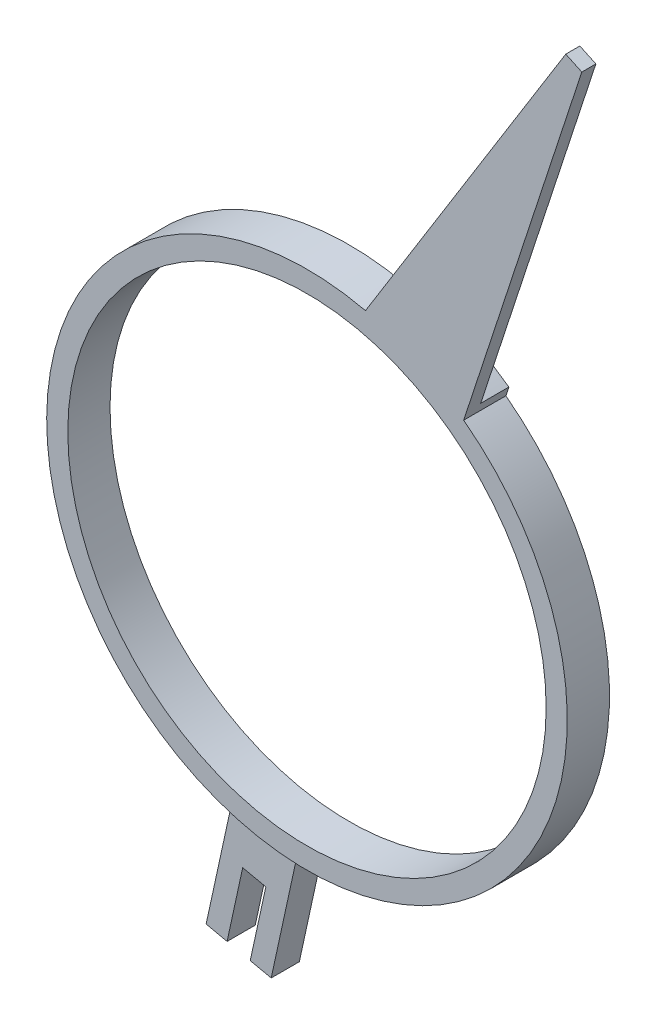
ISO-10303-21;
HEADER;
FILE_DESCRIPTION(('STEP AP214'),'2;1');
FILE_NAME('part.step','',(''),(''),'','','');
FILE_SCHEMA(('AUTOMOTIVE_DESIGN { 1 0 10303 214 1 1 1 1 }'));
ENDSEC;
DATA;
#1=APPLICATION_CONTEXT('core data for automotive mechanical design processes');
#2=APPLICATION_PROTOCOL_DEFINITION('international standard','automotive_design',2000,#1);
#3=PRODUCT_CONTEXT('',#1,'mechanical');
#4=PRODUCT('Part','Part','',(#3));
#5=PRODUCT_RELATED_PRODUCT_CATEGORY('part','',(#4));
#6=PRODUCT_DEFINITION_FORMATION('','',#4);
#7=PRODUCT_DEFINITION_CONTEXT('part definition',#1,'design');
#8=PRODUCT_DEFINITION('design','',#6,#7);
#9=PRODUCT_DEFINITION_SHAPE('','',#8);
#10=(LENGTH_UNIT() NAMED_UNIT(*) SI_UNIT(.MILLI.,.METRE.));
#11=(NAMED_UNIT(*) PLANE_ANGLE_UNIT() SI_UNIT($,.RADIAN.));
#12=(NAMED_UNIT(*) SI_UNIT($,.STERADIAN.) SOLID_ANGLE_UNIT());
#13=UNCERTAINTY_MEASURE_WITH_UNIT(LENGTH_MEASURE(1.E-05),#10,'distance_accuracy_value','');
#14=(GEOMETRIC_REPRESENTATION_CONTEXT(3) GLOBAL_UNCERTAINTY_ASSIGNED_CONTEXT((#13)) GLOBAL_UNIT_ASSIGNED_CONTEXT((#10,
#11,#12)) REPRESENTATION_CONTEXT('',''));
#15=CARTESIAN_POINT('',(0.,0.,0.));
#16=DIRECTION('',(0.,0.,1.));
#17=DIRECTION('',(1.,0.,0.));
#18=AXIS2_PLACEMENT_3D('',#15,#16,#17);
#19=CARTESIAN_POINT('',(43.5290437530011,-12.4127182523964,15.853626427053));
#20=DIRECTION('',(0.,0.,-1.));
#21=DIRECTION('',(-1.,0.,0.));
#22=AXIS2_PLACEMENT_3D('',#19,#20,#21);
#23=PLANE('',#22);
#24=CARTESIAN_POINT('',(41.7501136263386,-16.1950909558502,15.853626427053));
#25=DIRECTION('',(0.,0.,1.));
#26=DIRECTION('',(1.,0.,0.));
#27=AXIS2_PLACEMENT_3D('',#24,#25,#26);
#28=CIRCLE('',#27,2.33562450801026);
#29=CARTESIAN_POINT('',(42.3011564932952,-13.9254007564629,15.853626427053));
#30=VERTEX_POINT('',#29);
#31=CARTESIAN_POINT('',(43.1345936638932,-14.3140388917033,15.853626427053));
#32=VERTEX_POINT('',#31);
#33=EDGE_CURVE('E39',#30,#32,#28,.F.);
#34=ORIENTED_EDGE('',*,*,#33,.F.);
#35=DIRECTION('',(-0.527834877618406,-0.849347009160309,0.));
#36=VECTOR('',#35,1.);
#37=CARTESIAN_POINT('',(43.1256855131825,-12.5986387581521,15.853626427053));
#38=LINE('',#37,#36);
#39=CARTESIAN_POINT('',(43.9939867514361,-11.2014422275097,15.853626427053));
#40=VERTEX_POINT('',#39);
#41=EDGE_CURVE('E120',#40,#30,#38,.T.);
#42=ORIENTED_EDGE('',*,*,#41,.F.);
#43=DIRECTION('',(-0.906307787036659,0.422618261740681,0.));
#44=VECTOR('',#43,1.);
#45=CARTESIAN_POINT('',(44.0635616972437,-11.2338855575556,15.853626427053));
#46=LINE('',#45,#44);
#47=CARTESIAN_POINT('',(44.1331366430485,-11.2663288876003,15.853626427053));
#48=VERTEX_POINT('',#47);
#49=EDGE_CURVE('E101',#48,#40,#46,.T.);
#50=ORIENTED_EDGE('',*,*,#49,.F.);
#51=DIRECTION('',(0.311351837353415,0.950294708696546,0.));
#52=VECTOR('',#51,1.);
#53=CARTESIAN_POINT('',(43.6209552822299,-12.8295868443111,15.853626427053));
#54=LINE('',#53,#52);
#55=EDGE_CURVE('E110',#32,#48,#54,.T.);
#56=ORIENTED_EDGE('',*,*,#55,.F.);
#57=EDGE_LOOP('',(#34,#42,#50,#56));
#58=FACE_BOUND('',#57,.T.);
#59=ADVANCED_FACE('F36',(#58),#23,.T.);
#60=CARTESIAN_POINT('',(43.6209552822299,-12.8295868443111,15.609626427053));
#61=DIRECTION('',(0.950294708696546,-0.311351837353415,0.));
#62=DIRECTION('',(0.311351837353415,0.950294708696546,0.));
#63=AXIS2_PLACEMENT_3D('',#60,#61,#62);
#64=PLANE('',#63);
#65=DIRECTION('',(0.,0.,1.));
#66=VECTOR('',#65,1.);
#67=CARTESIAN_POINT('',(43.1345936638933,-14.3140388917034,15.609626427053));
#68=LINE('',#67,#66);
#69=CARTESIAN_POINT('',(43.1345936638932,-14.3140388917033,15.609626427053));
#70=VERTEX_POINT('',#69);
#71=EDGE_CURVE('E117',#32,#70,#68,.F.);
#72=ORIENTED_EDGE('',*,*,#71,.F.);
#73=ORIENTED_EDGE('',*,*,#55,.T.);
#74=DIRECTION('',(0.,0.,1.));
#75=VECTOR('',#74,1.);
#76=CARTESIAN_POINT('',(44.1331366430485,-11.2663288876,15.609626427053));
#77=LINE('',#76,#75);
#78=CARTESIAN_POINT('',(44.1331366430483,-11.2663288876005,15.975626427053));
#79=VERTEX_POINT('',#78);
#80=EDGE_CURVE('E113',#79,#48,#77,.F.);
#81=ORIENTED_EDGE('',*,*,#80,.F.);
#82=DIRECTION('',(0.311351837353128,0.950294708696639,0.));
#83=VECTOR('',#82,1.);
#84=CARTESIAN_POINT('',(43.1087739214115,-14.3928448010216,15.975626427053));
#85=LINE('',#84,#83);
#86=CARTESIAN_POINT('',(43.1087739214112,-14.3928448010217,15.975626427053));
#87=VERTEX_POINT('',#86);
#88=EDGE_CURVE('E185',#87,#79,#85,.T.);
#89=ORIENTED_EDGE('',*,*,#88,.F.);
#90=DIRECTION('',(0.,0.,1.));
#91=VECTOR('',#90,1.);
#92=CARTESIAN_POINT('',(43.1087739214111,-14.3928448010214,15.609626427053));
#93=LINE('',#92,#91);
#94=CARTESIAN_POINT('',(43.108773921411,-14.3928448010216,15.609626427053));
#95=VERTEX_POINT('',#94);
#96=EDGE_CURVE('E135',#87,#95,#93,.F.);
#97=ORIENTED_EDGE('',*,*,#96,.T.);
#98=DIRECTION('',(0.311351837353415,0.950294708696546,0.));
#99=VECTOR('',#98,1.);
#100=CARTESIAN_POINT('',(43.6209552822299,-12.8295868443111,15.609626427053));
#101=LINE('',#100,#99);
#102=EDGE_CURVE('E118',#95,#70,#101,.T.);
#103=ORIENTED_EDGE('',*,*,#102,.T.);
#104=EDGE_LOOP('',(#72,#73,#81,#89,#97,#103));
#105=FACE_BOUND('',#104,.T.);
#106=ADVANCED_FACE('F111',(#105),#64,.T.);
#107=CARTESIAN_POINT('',(44.0635616972437,-11.2338855575556,15.609626427053));
#108=DIRECTION('',(0.422618261740681,0.906307787036659,0.));
#109=DIRECTION('',(-0.906307787036659,0.422618261740681,0.));
#110=AXIS2_PLACEMENT_3D('',#107,#108,#109);
#111=PLANE('',#110);
#112=ORIENTED_EDGE('',*,*,#80,.T.);
#113=ORIENTED_EDGE('',*,*,#49,.T.);
#114=DIRECTION('',(0.,0.,1.));
#115=VECTOR('',#114,1.);
#116=CARTESIAN_POINT('',(43.9939867514357,-11.2014422275095,15.609626427053));
#117=LINE('',#116,#115);
#118=CARTESIAN_POINT('',(43.9939867514365,-11.20144222751,15.975626427053));
#119=VERTEX_POINT('',#118);
#120=EDGE_CURVE('E149',#119,#40,#117,.F.);
#121=ORIENTED_EDGE('',*,*,#120,.F.);
#122=DIRECTION('',(-0.906307787034976,0.42261826174429,0.));
#123=VECTOR('',#122,1.);
#124=CARTESIAN_POINT('',(44.1331366430482,-11.2663288876007,15.975626427053));
#125=LINE('',#124,#123);
#126=EDGE_CURVE('E126',#79,#119,#125,.T.);
#127=ORIENTED_EDGE('',*,*,#126,.F.);
#128=EDGE_LOOP('',(#112,#113,#121,#127));
#129=FACE_BOUND('',#128,.T.);
#130=ADVANCED_FACE('F124',(#129),#111,.T.);
#131=CARTESIAN_POINT('',(43.1256855131825,-12.5986387581521,15.609626427053));
#132=DIRECTION('',(-0.849347009160309,0.527834877618406,0.));
#133=DIRECTION('',(-0.527834877618406,-0.849347009160309,0.));
#134=AXIS2_PLACEMENT_3D('',#131,#132,#133);
#135=PLANE('',#134);
#136=ORIENTED_EDGE('',*,*,#120,.T.);
#137=ORIENTED_EDGE('',*,*,#41,.T.);
#138=DIRECTION('',(0.,0.,1.));
#139=VECTOR('',#138,1.);
#140=CARTESIAN_POINT('',(42.3011564932952,-13.9254007564629,15.609626427053));
#141=LINE('',#140,#139);
#142=CARTESIAN_POINT('',(42.3011564932952,-13.9254007564629,15.609626427053));
#143=VERTEX_POINT('',#142);
#144=EDGE_CURVE('E225',#143,#30,#141,.T.);
#145=ORIENTED_EDGE('',*,*,#144,.F.);
#146=DIRECTION('',(-0.527834877618406,-0.849347009160309,0.));
#147=VECTOR('',#146,1.);
#148=CARTESIAN_POINT('',(43.1256855131825,-12.5986387581521,15.609626427053));
#149=LINE('',#148,#147);
#150=CARTESIAN_POINT('',(42.2573842749298,-13.9958352887938,15.609626427053));
#151=VERTEX_POINT('',#150);
#152=EDGE_CURVE('E122',#143,#151,#149,.T.);
#153=ORIENTED_EDGE('',*,*,#152,.T.);
#154=DIRECTION('',(0.,0.,1.));
#155=VECTOR('',#154,1.);
#156=CARTESIAN_POINT('',(42.25738427493,-13.9958352887934,15.609626427053));
#157=LINE('',#156,#155);
#158=CARTESIAN_POINT('',(42.2573842749302,-13.9958352887939,15.975626427053));
#159=VERTEX_POINT('',#158);
#160=EDGE_CURVE('E147',#151,#159,#157,.T.);
#161=ORIENTED_EDGE('',*,*,#160,.T.);
#162=DIRECTION('',(-0.527834877618577,-0.849347009160203,0.));
#163=VECTOR('',#162,1.);
#164=CARTESIAN_POINT('',(43.9939867514369,-11.2014422275102,15.975626427053));
#165=LINE('',#164,#163);
#166=EDGE_CURVE('E174',#119,#159,#165,.T.);
#167=ORIENTED_EDGE('',*,*,#166,.F.);
#168=EDGE_LOOP('',(#136,#137,#145,#153,#161,#167));
#169=FACE_BOUND('',#168,.T.);
#170=ADVANCED_FACE('F277',(#169),#135,.T.);
#171=CARTESIAN_POINT('',(41.7501136263386,-16.1950909558502,15.609626427053));
#172=DIRECTION('',(0.,0.,1.));
#173=DIRECTION('',(1.,0.,0.));
#174=AXIS2_PLACEMENT_3D('',#171,#172,#173);
#175=CYLINDRICAL_SURFACE('',#174,2.33562450801026);
#176=CARTESIAN_POINT('',(41.7501136263386,-16.1950909558502,15.609626427053));
#177=DIRECTION('',(0.,0.,1.));
#178=DIRECTION('',(1.,0.,0.));
#179=AXIS2_PLACEMENT_3D('',#176,#177,#178);
#180=CIRCLE('',#179,2.33562450801026);
#181=EDGE_CURVE('E167',#70,#143,#180,.T.);
#182=ORIENTED_EDGE('',*,*,#181,.T.);
#183=ORIENTED_EDGE('',*,*,#144,.T.);
#184=ORIENTED_EDGE('',*,*,#33,.T.);
#185=ORIENTED_EDGE('',*,*,#71,.T.);
#186=EDGE_LOOP('',(#182,#183,#184,#185));
#187=FACE_BOUND('',#186,.T.);
#188=ADVANCED_FACE('F438',(#187),#175,.T.);
#189=CARTESIAN_POINT('',(41.7501136263386,-16.1950909558502,15.609626427053));
#190=DIRECTION('',(0.,0.,1.));
#191=DIRECTION('',(1.,0.,0.));
#192=AXIS2_PLACEMENT_3D('',#189,#190,#191);
#193=CYLINDRICAL_SURFACE('',#192,2.074);
#194=CARTESIAN_POINT('',(41.7501136263386,-16.1950909558502,15.609626427053));
#195=DIRECTION('',(0.,0.,1.));
#196=DIRECTION('',(1.,0.,0.));
#197=AXIS2_PLACEMENT_3D('',#194,#195,#196);
#198=CIRCLE('',#197,2.074);
#199=CARTESIAN_POINT('',(43.8241136263386,-16.1950909558502,15.609626427053));
#200=VERTEX_POINT('',#199);
#201=EDGE_CURVE('E162',#200,#200,#198,.F.);
#202=ORIENTED_EDGE('',*,*,#201,.T.);
#203=EDGE_LOOP('',(#202));
#204=FACE_BOUND('',#203,.T.);
#205=CARTESIAN_POINT('',(41.7501136263386,-16.1950909558502,15.975626427053));
#206=DIRECTION('',(0.,0.,1.));
#207=DIRECTION('',(1.,0.,0.));
#208=AXIS2_PLACEMENT_3D('',#205,#206,#207);
#209=CIRCLE('',#208,2.074);
#210=CARTESIAN_POINT('',(43.8241136263386,-16.1950909558502,15.975626427053));
#211=VERTEX_POINT('',#210);
#212=EDGE_CURVE('E171',#211,#211,#209,.F.);
#213=ORIENTED_EDGE('',*,*,#212,.F.);
#214=EDGE_LOOP('',(#213));
#215=FACE_BOUND('',#214,.T.);
#216=ADVANCED_FACE('F429',(#204,#215),#193,.F.);
#217=CARTESIAN_POINT('',(40.9921043530501,-19.1941461657869,15.853626427053));
#218=DIRECTION('',(-0.977112472939913,0.212723330232603,0.));
#219=DIRECTION('',(-0.212723330232603,-0.977112472939913,0.));
#220=AXIS2_PLACEMENT_3D('',#217,#218,#219);
#221=PLANE('',#220);
#222=DIRECTION('',(-0.212723330231915,-0.977112472940062,0.));
#223=VECTOR('',#222,1.);
#224=CARTESIAN_POINT('',(41.0706923021899,-18.8331642967806,15.853626427053));
#225=LINE('',#224,#223);
#226=CARTESIAN_POINT('',(41.0706923021899,-18.8331642967806,15.853626427053));
#227=VERTEX_POINT('',#226);
#228=CARTESIAN_POINT('',(40.9353760737111,-19.4547189447533,15.853626427053));
#229=VERTEX_POINT('',#228);
#230=EDGE_CURVE('E165',#227,#229,#225,.T.);
#231=ORIENTED_EDGE('',*,*,#230,.T.);
#232=DIRECTION('',(0.,0.,1.));
#233=VECTOR('',#232,1.);
#234=CARTESIAN_POINT('',(40.9353760737109,-19.4547189447544,15.609626427053));
#235=LINE('',#234,#233);
#236=CARTESIAN_POINT('',(40.935376073711,-19.4547189447536,15.609626427053));
#237=VERTEX_POINT('',#236);
#238=EDGE_CURVE('E212',#237,#229,#235,.T.);
#239=ORIENTED_EDGE('',*,*,#238,.F.);
#240=DIRECTION('',(0.212723330231915,0.977112472940062,0.));
#241=VECTOR('',#240,1.);
#242=CARTESIAN_POINT('',(40.9353760737112,-19.4547189447528,15.609626427053));
#243=LINE('',#242,#241);
#244=CARTESIAN_POINT('',(41.0706923021899,-18.8331642967806,15.609626427053));
#245=VERTEX_POINT('',#244);
#246=EDGE_CURVE('E173',#237,#245,#243,.T.);
#247=ORIENTED_EDGE('',*,*,#246,.T.);
#248=DIRECTION('',(0.,0.,1.));
#249=VECTOR('',#248,1.);
#250=CARTESIAN_POINT('',(41.07069230219,-18.8331642967805,15.853626427053));
#251=LINE('',#250,#249);
#252=EDGE_CURVE('E236',#245,#227,#251,.T.);
#253=ORIENTED_EDGE('',*,*,#252,.T.);
#254=EDGE_LOOP('',(#231,#239,#247,#253));
#255=FACE_BOUND('',#254,.T.);
#256=ADVANCED_FACE('F329',(#255),#221,.F.);
#257=CARTESIAN_POINT('',(41.0357170274446,-19.4765637808691,15.609626427053));
#258=DIRECTION('',(-0.212723330232603,-0.977112472939913,0.));
#259=DIRECTION('',(0.977112472939913,-0.212723330232603,0.));
#260=AXIS2_PLACEMENT_3D('',#257,#258,#259);
#261=PLANE('',#260);
#262=DIRECTION('',(0.977112472939975,-0.212723330232314,0.));
#263=VECTOR('',#262,1.);
#264=CARTESIAN_POINT('',(40.7535907168474,-19.4151431665589,15.609626427053));
#265=LINE('',#264,#263);
#266=CARTESIAN_POINT('',(40.7535907168473,-19.4151431665589,15.609626427053));
#267=VERTEX_POINT('',#266);
#268=EDGE_CURVE('E166',#267,#237,#265,.T.);
#269=ORIENTED_EDGE('',*,*,#268,.T.);
#270=ORIENTED_EDGE('',*,*,#238,.T.);
#271=DIRECTION('',(-0.977112472939975,0.212723330232314,0.));
#272=VECTOR('',#271,1.);
#273=CARTESIAN_POINT('',(40.9353760737112,-19.4547189447528,15.853626427053));
#274=LINE('',#273,#272);
#275=CARTESIAN_POINT('',(40.7535907168473,-19.4151431665589,15.853626427053));
#276=VERTEX_POINT('',#275);
#277=EDGE_CURVE('E217',#229,#276,#274,.T.);
#278=ORIENTED_EDGE('',*,*,#277,.T.);
#279=DIRECTION('',(0.,0.,1.));
#280=VECTOR('',#279,1.);
#281=CARTESIAN_POINT('',(40.7535907168472,-19.4151431665589,15.609626427053));
#282=LINE('',#281,#280);
#283=EDGE_CURVE('E198',#267,#276,#282,.T.);
#284=ORIENTED_EDGE('',*,*,#283,.F.);
#285=EDGE_LOOP('',(#269,#270,#278,#284));
#286=FACE_BOUND('',#285,.T.);
#287=ADVANCED_FACE('F331',(#286),#261,.T.);
#288=CARTESIAN_POINT('',(40.8727032041358,-18.8680179552087,15.609626427053));
#289=DIRECTION('',(-0.977112472939913,0.212723330232603,0.));
#290=DIRECTION('',(-0.212723330232603,-0.977112472939913,0.));
#291=AXIS2_PLACEMENT_3D('',#288,#289,#290);
#292=PLANE('',#291);
#293=ORIENTED_EDGE('',*,*,#283,.T.);
#294=DIRECTION('',(0.212723330232238,0.977112472939992,0.));
#295=VECTOR('',#294,1.);
#296=CARTESIAN_POINT('',(40.7535907168474,-19.4151431665589,15.853626427053));
#297=LINE('',#296,#295);
#298=CARTESIAN_POINT('',(40.9918156914242,-18.3208927438591,15.853626427053));
#299=VERTEX_POINT('',#298);
#300=EDGE_CURVE('E220',#276,#299,#297,.T.);
#301=ORIENTED_EDGE('',*,*,#300,.T.);
#302=DIRECTION('',(0.,0.,1.));
#303=VECTOR('',#302,1.);
#304=CARTESIAN_POINT('',(40.9918156914245,-18.3208927438585,15.609626427053));
#305=LINE('',#304,#303);
#306=CARTESIAN_POINT('',(40.9918156914242,-18.3208927438591,15.609626427053));
#307=VERTEX_POINT('',#306);
#308=EDGE_CURVE('E209',#299,#307,#305,.F.);
#309=ORIENTED_EDGE('',*,*,#308,.T.);
#310=DIRECTION('',(-0.212723330232238,-0.977112472939992,0.));
#311=VECTOR('',#310,1.);
#312=CARTESIAN_POINT('',(40.9918156914243,-18.3208927438584,15.609626427053));
#313=LINE('',#312,#311);
#314=EDGE_CURVE('E169',#307,#267,#313,.T.);
#315=ORIENTED_EDGE('',*,*,#314,.T.);
#316=EDGE_LOOP('',(#293,#301,#309,#315));
#317=FACE_BOUND('',#316,.T.);
#318=ADVANCED_FACE('F351',(#317),#292,.T.);
#319=CARTESIAN_POINT('',(41.4369558253278,-18.9908591838266,15.609626427053));
#320=DIRECTION('',(0.977112472939913,-0.212723330232603,0.));
#321=DIRECTION('',(0.212723330232603,0.977112472939913,0.));
#322=AXIS2_PLACEMENT_3D('',#319,#320,#321);
#323=PLANE('',#322);
#324=DIRECTION('',(0.,0.,1.));
#325=VECTOR('',#324,1.);
#326=CARTESIAN_POINT('',(41.5560683126165,-18.4437339724759,15.609626427053));
#327=LINE('',#326,#325);
#328=CARTESIAN_POINT('',(41.5560683126175,-18.4437339724763,15.609626427053));
#329=VERTEX_POINT('',#328);
#330=CARTESIAN_POINT('',(41.5560683126175,-18.4437339724763,15.853626427053));
#331=VERTEX_POINT('',#330);
#332=EDGE_CURVE('E54',#329,#331,#327,.T.);
#333=ORIENTED_EDGE('',*,*,#332,.T.);
#334=DIRECTION('',(-0.212723330234319,-0.977112472939539,0.));
#335=VECTOR('',#334,1.);
#336=CARTESIAN_POINT('',(41.5560683126187,-18.4437339724763,15.853626427053));
#337=LINE('',#336,#335);
#338=CARTESIAN_POINT('',(41.3178433380393,-19.5379843951769,15.853626427053));
#339=VERTEX_POINT('',#338);
#340=EDGE_CURVE('E206',#331,#339,#337,.T.);
#341=ORIENTED_EDGE('',*,*,#340,.T.);
#342=DIRECTION('',(0.,0.,1.));
#343=VECTOR('',#342,1.);
#344=CARTESIAN_POINT('',(41.3178433380393,-19.537984395177,15.609626427053));
#345=LINE('',#344,#343);
#346=CARTESIAN_POINT('',(41.3178433380393,-19.5379843951769,15.609626427053));
#347=VERTEX_POINT('',#346);
#348=EDGE_CURVE('E197',#347,#339,#345,.T.);
#349=ORIENTED_EDGE('',*,*,#348,.F.);
#350=DIRECTION('',(0.212723330234319,0.977112472939539,0.));
#351=VECTOR('',#350,1.);
#352=CARTESIAN_POINT('',(41.3178433380393,-19.5379843951768,15.609626427053));
#353=LINE('',#352,#351);
#354=EDGE_CURVE('E170',#347,#329,#353,.T.);
#355=ORIENTED_EDGE('',*,*,#354,.T.);
#356=EDGE_LOOP('',(#333,#341,#349,#355));
#357=FACE_BOUND('',#356,.T.);
#358=ADVANCED_FACE('F342',(#357),#323,.T.);
#359=CARTESIAN_POINT('',(41.0357170274446,-19.4765637808691,15.609626427053));
#360=DIRECTION('',(-0.212723330232603,-0.977112472939913,0.));
#361=DIRECTION('',(0.977112472939913,-0.212723330232603,0.));
#362=AXIS2_PLACEMENT_3D('',#359,#360,#361);
#363=PLANE('',#362);
#364=DIRECTION('',(-0.977112472937942,0.212723330241655,0.));
#365=VECTOR('',#364,1.);
#366=CARTESIAN_POINT('',(41.3178433380393,-19.5379843951768,15.853626427053));
#367=LINE('',#366,#365);
#368=CARTESIAN_POINT('',(41.1360581790573,-19.4984086600615,15.853626427053));
#369=VERTEX_POINT('',#368);
#370=EDGE_CURVE('E142',#339,#369,#367,.T.);
#371=ORIENTED_EDGE('',*,*,#370,.T.);
#372=DIRECTION('',(0.,0.,1.));
#373=VECTOR('',#372,1.);
#374=CARTESIAN_POINT('',(41.1360581790578,-19.4984086600613,15.853626427053));
#375=LINE('',#374,#373);
#376=CARTESIAN_POINT('',(41.1360581790573,-19.4984086600612,15.609626427053));
#377=VERTEX_POINT('',#376);
#378=EDGE_CURVE('E201',#369,#377,#375,.F.);
#379=ORIENTED_EDGE('',*,*,#378,.T.);
#380=DIRECTION('',(0.977112472937942,-0.212723330241655,0.));
#381=VECTOR('',#380,1.);
#382=CARTESIAN_POINT('',(41.1360581790571,-19.4984086600611,15.609626427053));
#383=LINE('',#382,#381);
#384=EDGE_CURVE('E248',#377,#347,#383,.T.);
#385=ORIENTED_EDGE('',*,*,#384,.T.);
#386=ORIENTED_EDGE('',*,*,#348,.T.);
#387=EDGE_LOOP('',(#371,#379,#385,#386));
#388=FACE_BOUND('',#387,.T.);
#389=ADVANCED_FACE('F322',(#388),#363,.T.);
#390=CARTESIAN_POINT('',(41.1927864583959,-19.2378358810952,15.853626427053));
#391=DIRECTION('',(0.977112472939913,-0.212723330232603,0.));
#392=DIRECTION('',(0.212723330232603,0.977112472939913,0.));
#393=AXIS2_PLACEMENT_3D('',#390,#391,#392);
#394=PLANE('',#393);
#395=DIRECTION('',(0.212723330231915,0.977112472940062,0.));
#396=VECTOR('',#395,1.);
#397=CARTESIAN_POINT('',(41.1360581790571,-19.4984086600611,15.853626427053));
#398=LINE('',#397,#396);
#399=CARTESIAN_POINT('',(41.2713744075361,-18.8768540120891,15.853626427053));
#400=VERTEX_POINT('',#399);
#401=EDGE_CURVE('E138',#369,#400,#398,.T.);
#402=ORIENTED_EDGE('',*,*,#401,.T.);
#403=DIRECTION('',(0.,0.,1.));
#404=VECTOR('',#403,1.);
#405=CARTESIAN_POINT('',(41.2713744075357,-18.8768540120891,15.853626427053));
#406=LINE('',#405,#404);
#407=CARTESIAN_POINT('',(41.2713744075358,-18.876854012089,15.609626427053));
#408=VERTEX_POINT('',#407);
#409=EDGE_CURVE('E193',#400,#408,#406,.F.);
#410=ORIENTED_EDGE('',*,*,#409,.T.);
#411=DIRECTION('',(-0.212723330231915,-0.977112472940062,0.));
#412=VECTOR('',#411,1.);
#413=CARTESIAN_POINT('',(41.2713744075358,-18.876854012089,15.609626427053));
#414=LINE('',#413,#412);
#415=EDGE_CURVE('E251',#408,#377,#414,.T.);
#416=ORIENTED_EDGE('',*,*,#415,.T.);
#417=ORIENTED_EDGE('',*,*,#378,.F.);
#418=EDGE_LOOP('',(#402,#410,#416,#417));
#419=FACE_BOUND('',#418,.T.);
#420=ADVANCED_FACE('F305',(#419),#394,.F.);
#421=CARTESIAN_POINT('',(41.1710333548628,-18.8550091544348,15.853626427053));
#422=DIRECTION('',(0.212723330232603,0.977112472939913,0.));
#423=DIRECTION('',(-0.977112472939913,0.212723330232603,0.));
#424=AXIS2_PLACEMENT_3D('',#421,#422,#423);
#425=PLANE('',#424);
#426=DIRECTION('',(-0.977112472940227,0.212723330231156,0.));
#427=VECTOR('',#426,1.);
#428=CARTESIAN_POINT('',(41.2713744075358,-18.876854012089,15.853626427053));
#429=LINE('',#428,#427);
#430=EDGE_CURVE('E141',#400,#227,#429,.T.);
#431=ORIENTED_EDGE('',*,*,#430,.T.);
#432=ORIENTED_EDGE('',*,*,#252,.F.);
#433=DIRECTION('',(0.977112472940227,-0.212723330231156,0.));
#434=VECTOR('',#433,1.);
#435=CARTESIAN_POINT('',(41.0706923021899,-18.8331642967806,15.609626427053));
#436=LINE('',#435,#434);
#437=EDGE_CURVE('E178',#245,#408,#436,.T.);
#438=ORIENTED_EDGE('',*,*,#437,.T.);
#439=ORIENTED_EDGE('',*,*,#409,.F.);
#440=EDGE_LOOP('',(#431,#432,#438,#439));
#441=FACE_BOUND('',#440,.T.);
#442=ADVANCED_FACE('F314',(#441),#425,.F.);
#443=CARTESIAN_POINT('',(42.3499106561628,-15.0600458085088,15.975626427053));
#444=DIRECTION('',(0.,0.,1.));
#445=DIRECTION('',(1.,0.,0.));
#446=AXIS2_PLACEMENT_3D('',#443,#444,#445);
#447=PLANE('',#446);
#448=ORIENTED_EDGE('',*,*,#212,.T.);
#449=EDGE_LOOP('',(#448));
#450=FACE_BOUND('',#449,.T.);
#451=ORIENTED_EDGE('',*,*,#126,.T.);
#452=ORIENTED_EDGE('',*,*,#166,.T.);
#453=CARTESIAN_POINT('',(41.7501136263386,-16.1950909558502,15.975626427053));
#454=DIRECTION('',(0.,0.,1.));
#455=DIRECTION('',(1.,0.,0.));
#456=AXIS2_PLACEMENT_3D('',#453,#454,#455);
#457=CIRCLE('',#456,2.257);
#458=EDGE_CURVE('E158',#87,#159,#457,.F.);
#459=ORIENTED_EDGE('',*,*,#458,.F.);
#460=ORIENTED_EDGE('',*,*,#88,.T.);
#461=EDGE_LOOP('',(#451,#452,#459,#460));
#462=FACE_BOUND('',#461,.T.);
#463=ADVANCED_FACE('F369',(#450,#462),#447,.T.);
#464=CARTESIAN_POINT('',(42.3499106561628,-15.0600458085088,15.609626427053));
#465=DIRECTION('',(0.,0.,1.));
#466=DIRECTION('',(1.,0.,0.));
#467=AXIS2_PLACEMENT_3D('',#464,#465,#466);
#468=PLANE('',#467);
#469=ORIENTED_EDGE('',*,*,#201,.F.);
#470=EDGE_LOOP('',(#469));
#471=FACE_BOUND('',#470,.T.);
#472=ORIENTED_EDGE('',*,*,#314,.F.);
#473=CARTESIAN_POINT('',(41.7501136263386,-16.1950909558502,15.609626427053));
#474=DIRECTION('',(0.,0.,1.));
#475=DIRECTION('',(1.,0.,0.));
#476=AXIS2_PLACEMENT_3D('',#473,#474,#475);
#477=CIRCLE('',#476,2.257);
#478=EDGE_CURVE('E45',#151,#307,#477,.T.);
#479=ORIENTED_EDGE('',*,*,#478,.F.);
#480=ORIENTED_EDGE('',*,*,#152,.F.);
#481=ORIENTED_EDGE('',*,*,#181,.F.);
#482=ORIENTED_EDGE('',*,*,#102,.F.);
#483=CARTESIAN_POINT('',(41.7501136263386,-16.1950909558502,15.609626427053));
#484=DIRECTION('',(0.,0.,1.));
#485=DIRECTION('',(1.,0.,0.));
#486=AXIS2_PLACEMENT_3D('',#483,#484,#485);
#487=CIRCLE('',#486,2.257);
#488=EDGE_CURVE('E160',#329,#95,#487,.T.);
#489=ORIENTED_EDGE('',*,*,#488,.F.);
#490=ORIENTED_EDGE('',*,*,#354,.F.);
#491=ORIENTED_EDGE('',*,*,#384,.F.);
#492=ORIENTED_EDGE('',*,*,#415,.F.);
#493=ORIENTED_EDGE('',*,*,#437,.F.);
#494=ORIENTED_EDGE('',*,*,#246,.F.);
#495=ORIENTED_EDGE('',*,*,#268,.F.);
#496=EDGE_LOOP('',(#472,#479,#480,#481,#482,#489,#490,#491,#492,#493,#494,#495));
#497=FACE_BOUND('',#496,.T.);
#498=ADVANCED_FACE('F318',(#471,#497),#468,.F.);
#499=CARTESIAN_POINT('',(41.1544817145076,-18.9310361372953,15.853626427053));
#500=DIRECTION('',(0.,0.,-1.));
#501=DIRECTION('',(-1.,0.,0.));
#502=AXIS2_PLACEMENT_3D('',#499,#500,#501);
#503=PLANE('',#502);
#504=ORIENTED_EDGE('',*,*,#401,.F.);
#505=ORIENTED_EDGE('',*,*,#370,.F.);
#506=ORIENTED_EDGE('',*,*,#340,.F.);
#507=CARTESIAN_POINT('',(41.7501136263386,-16.1950909558502,15.853626427053));
#508=DIRECTION('',(0.,0.,1.));
#509=DIRECTION('',(1.,0.,0.));
#510=AXIS2_PLACEMENT_3D('',#507,#508,#509);
#511=CIRCLE('',#510,2.257);
#512=EDGE_CURVE('E11',#299,#331,#511,.T.);
#513=ORIENTED_EDGE('',*,*,#512,.F.);
#514=ORIENTED_EDGE('',*,*,#300,.F.);
#515=ORIENTED_EDGE('',*,*,#277,.F.);
#516=ORIENTED_EDGE('',*,*,#230,.F.);
#517=ORIENTED_EDGE('',*,*,#430,.F.);
#518=EDGE_LOOP('',(#504,#505,#506,#513,#514,#515,#516,#517));
#519=FACE_BOUND('',#518,.T.);
#520=ADVANCED_FACE('F325',(#519),#503,.F.);
#521=CARTESIAN_POINT('',(41.7501136263386,-16.1950909558502,15.609626427053));
#522=DIRECTION('',(0.,0.,1.));
#523=DIRECTION('',(1.,0.,0.));
#524=AXIS2_PLACEMENT_3D('',#521,#522,#523);
#525=CYLINDRICAL_SURFACE('',#524,2.257);
#526=ORIENTED_EDGE('',*,*,#512,.T.);
#527=ORIENTED_EDGE('',*,*,#332,.F.);
#528=ORIENTED_EDGE('',*,*,#488,.T.);
#529=ORIENTED_EDGE('',*,*,#96,.F.);
#530=ORIENTED_EDGE('',*,*,#458,.T.);
#531=ORIENTED_EDGE('',*,*,#160,.F.);
#532=ORIENTED_EDGE('',*,*,#478,.T.);
#533=ORIENTED_EDGE('',*,*,#308,.F.);
#534=EDGE_LOOP('',(#526,#527,#528,#529,#530,#531,#532,#533));
#535=FACE_BOUND('',#534,.T.);
#536=ADVANCED_FACE('F345',(#535),#525,.T.);
#537=CLOSED_SHELL('',(#59,#106,#130,#170,#188,#216,#256,#287,#318,#358,#389,#420,#442,#463,#498,
#520,#536));
#538=MANIFOLD_SOLID_BREP('B2',#537);
#539=ADVANCED_BREP_SHAPE_REPRESENTATION('',(#18,#538),#14);
#540=SHAPE_DEFINITION_REPRESENTATION(#9,#539);
ENDSEC;
END-ISO-10303-21;
